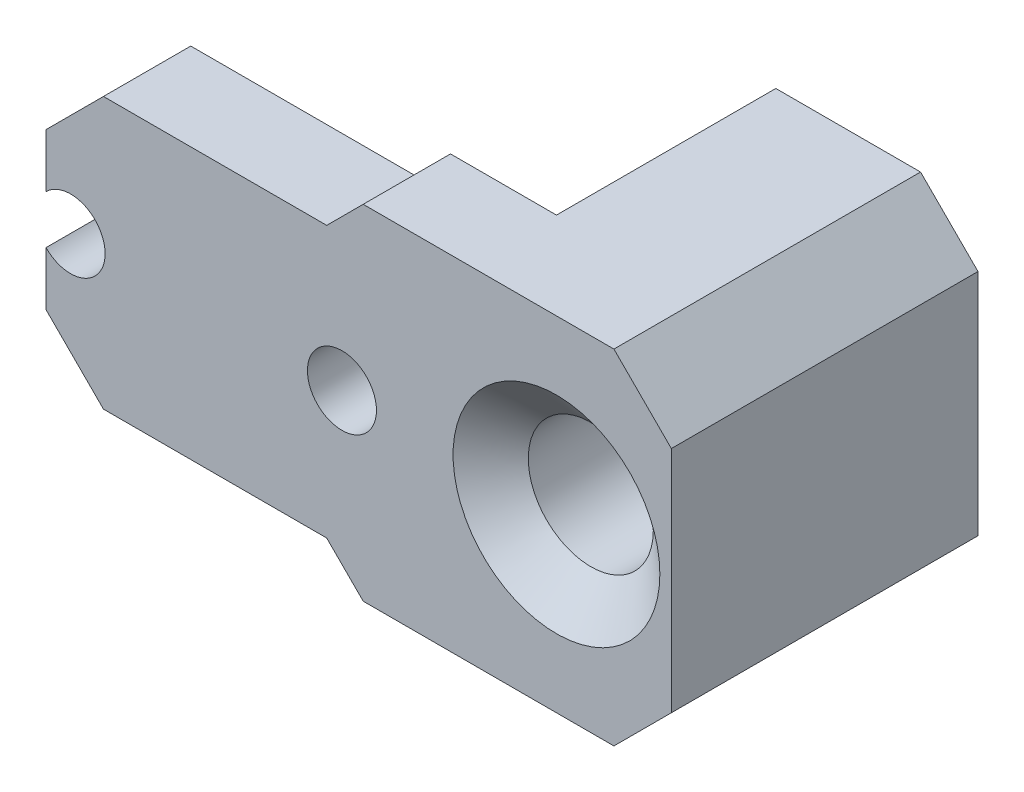
ISO-10303-21;
HEADER;
FILE_DESCRIPTION(('STEP AP214'),'2;1');
FILE_NAME('part.step','',(''),(''),'','','');
FILE_SCHEMA(('AUTOMOTIVE_DESIGN { 1 0 10303 214 1 1 1 1 }'));
ENDSEC;
DATA;
#1=APPLICATION_CONTEXT('core data for automotive mechanical design processes');
#2=APPLICATION_PROTOCOL_DEFINITION('international standard','automotive_design',2000,#1);
#3=PRODUCT_CONTEXT('',#1,'mechanical');
#4=PRODUCT('Part','Part','',(#3));
#5=PRODUCT_RELATED_PRODUCT_CATEGORY('part','',(#4));
#6=PRODUCT_DEFINITION_FORMATION('','',#4);
#7=PRODUCT_DEFINITION_CONTEXT('part definition',#1,'design');
#8=PRODUCT_DEFINITION('design','',#6,#7);
#9=PRODUCT_DEFINITION_SHAPE('','',#8);
#10=(LENGTH_UNIT() NAMED_UNIT(*) SI_UNIT(.MILLI.,.METRE.));
#11=(NAMED_UNIT(*) PLANE_ANGLE_UNIT() SI_UNIT($,.RADIAN.));
#12=(NAMED_UNIT(*) SI_UNIT($,.STERADIAN.) SOLID_ANGLE_UNIT());
#13=UNCERTAINTY_MEASURE_WITH_UNIT(LENGTH_MEASURE(1.E-05),#10,'distance_accuracy_value','');
#14=(GEOMETRIC_REPRESENTATION_CONTEXT(3) GLOBAL_UNCERTAINTY_ASSIGNED_CONTEXT((#13)) GLOBAL_UNIT_ASSIGNED_CONTEXT((#10,
#11,#12)) REPRESENTATION_CONTEXT('',''));
#15=CARTESIAN_POINT('',(0.,0.,0.));
#16=DIRECTION('',(0.,0.,1.));
#17=DIRECTION('',(1.,0.,0.));
#18=AXIS2_PLACEMENT_3D('',#15,#16,#17);
#19=CARTESIAN_POINT('',(12.604,-3.742,8.475));
#20=DIRECTION('',(0.,1.,0.));
#21=DIRECTION('',(-1.,0.,0.));
#22=AXIS2_PLACEMENT_3D('',#19,#20,#21);
#23=PLANE('',#22);
#24=DIRECTION('',(0.,0.,-1.));
#25=VECTOR('',#24,1.);
#26=CARTESIAN_POINT('',(-3.09192028803229,-3.742,8.475));
#27=LINE('',#26,#25);
#28=CARTESIAN_POINT('',(-3.09192028803229,-3.742,8.475));
#29=VERTEX_POINT('',#28);
#30=CARTESIAN_POINT('',(-3.09192028803229,-3.742,6.062));
#31=VERTEX_POINT('',#30);
#32=EDGE_CURVE('E334',#29,#31,#27,.T.);
#33=ORIENTED_EDGE('',*,*,#32,.T.);
#34=DIRECTION('',(1.,0.,0.));
#35=VECTOR('',#34,1.);
#36=CARTESIAN_POINT('',(12.604,-3.742,6.062));
#37=LINE('',#36,#35);
#38=CARTESIAN_POINT('',(3.07899999999998,-3.742,6.062));
#39=VERTEX_POINT('',#38);
#40=EDGE_CURVE('E454',#31,#39,#37,.T.);
#41=ORIENTED_EDGE('',*,*,#40,.T.);
#42=DIRECTION('',(0.,0.,1.));
#43=VECTOR('',#42,1.);
#44=CARTESIAN_POINT('',(3.07899999999998,-3.742,8.475));
#45=LINE('',#44,#43);
#46=CARTESIAN_POINT('',(3.07899999999998,-3.742,8.475));
#47=VERTEX_POINT('',#46);
#48=EDGE_CURVE('E317',#39,#47,#45,.T.);
#49=ORIENTED_EDGE('',*,*,#48,.T.);
#50=DIRECTION('',(1.,0.,0.));
#51=VECTOR('',#50,1.);
#52=CARTESIAN_POINT('',(12.604,-3.742,8.475));
#53=LINE('',#52,#51);
#54=EDGE_CURVE('E266',#29,#47,#53,.T.);
#55=ORIENTED_EDGE('',*,*,#54,.F.);
#56=EDGE_LOOP('',(#33,#41,#49,#55));
#57=FACE_BOUND('',#56,.T.);
#58=ADVANCED_FACE('F40',(#57),#23,.F.);
#59=CARTESIAN_POINT('',(12.604,3.742,8.475));
#60=DIRECTION('',(0.,-1.,0.));
#61=DIRECTION('',(1.,0.,0.));
#62=AXIS2_PLACEMENT_3D('',#59,#60,#61);
#63=PLANE('',#62);
#64=DIRECTION('',(0.,0.,-1.));
#65=VECTOR('',#64,1.);
#66=CARTESIAN_POINT('',(3.07899999999995,3.742,5.3));
#67=LINE('',#66,#65);
#68=CARTESIAN_POINT('',(3.07899999999995,3.742,8.475));
#69=VERTEX_POINT('',#68);
#70=CARTESIAN_POINT('',(3.07899999999995,3.742,6.062));
#71=VERTEX_POINT('',#70);
#72=EDGE_CURVE('E299',#69,#71,#67,.T.);
#73=ORIENTED_EDGE('',*,*,#72,.T.);
#74=DIRECTION('',(-1.,0.,0.));
#75=VECTOR('',#74,1.);
#76=CARTESIAN_POINT('',(12.604,3.742,6.062));
#77=LINE('',#76,#75);
#78=CARTESIAN_POINT('',(-3.09192028803229,3.742,6.062));
#79=VERTEX_POINT('',#78);
#80=EDGE_CURVE('E438',#71,#79,#77,.T.);
#81=ORIENTED_EDGE('',*,*,#80,.T.);
#82=DIRECTION('',(0.,0.,1.));
#83=VECTOR('',#82,1.);
#84=CARTESIAN_POINT('',(-3.09192028803229,3.742,8.475));
#85=LINE('',#84,#83);
#86=CARTESIAN_POINT('',(-3.09192028803228,3.742,8.475));
#87=VERTEX_POINT('',#86);
#88=EDGE_CURVE('E355',#79,#87,#85,.T.);
#89=ORIENTED_EDGE('',*,*,#88,.T.);
#90=DIRECTION('',(-1.,0.,0.));
#91=VECTOR('',#90,1.);
#92=CARTESIAN_POINT('',(12.604,3.742,8.475));
#93=LINE('',#92,#91);
#94=EDGE_CURVE('E288',#69,#87,#93,.T.);
#95=ORIENTED_EDGE('',*,*,#94,.F.);
#96=EDGE_LOOP('',(#73,#81,#89,#95));
#97=FACE_BOUND('',#96,.T.);
#98=ADVANCED_FACE('F542',(#97),#63,.F.);
#99=CARTESIAN_POINT('',(-4.67942028803229,-3.742,8.475));
#100=DIRECTION('',(1.,0.,0.));
#101=DIRECTION('',(0.,0.,-1.));
#102=AXIS2_PLACEMENT_3D('',#99,#100,#101);
#103=PLANE('',#102);
#104=DIRECTION('',(0.,0.,-1.));
#105=VECTOR('',#104,1.);
#106=CARTESIAN_POINT('',(-4.67942028803229,2.1545,8.475));
#107=LINE('',#106,#105);
#108=CARTESIAN_POINT('',(-4.67942028803229,2.1545,8.475));
#109=VERTEX_POINT('',#108);
#110=CARTESIAN_POINT('',(-4.67942028803229,2.1545,6.062));
#111=VERTEX_POINT('',#110);
#112=EDGE_CURVE('E352',#109,#111,#107,.T.);
#113=ORIENTED_EDGE('',*,*,#112,.T.);
#114=DIRECTION('',(0.,-1.,0.));
#115=VECTOR('',#114,1.);
#116=CARTESIAN_POINT('',(-4.67942028803229,-3.742,6.062));
#117=LINE('',#116,#115);
#118=CARTESIAN_POINT('',(-4.67942028803229,0.669704466320867,6.062));
#119=VERTEX_POINT('',#118);
#120=EDGE_CURVE('E250',#111,#119,#117,.T.);
#121=ORIENTED_EDGE('',*,*,#120,.T.);
#122=DIRECTION('',(0.,0.,1.));
#123=VECTOR('',#122,1.);
#124=CARTESIAN_POINT('',(-4.67942028803229,0.669704466320867,0.));
#125=LINE('',#124,#123);
#126=CARTESIAN_POINT('',(-4.67942028803229,0.669704466320867,8.475));
#127=VERTEX_POINT('',#126);
#128=EDGE_CURVE('E243',#119,#127,#125,.T.);
#129=ORIENTED_EDGE('',*,*,#128,.T.);
#130=DIRECTION('',(0.,-1.,0.));
#131=VECTOR('',#130,1.);
#132=CARTESIAN_POINT('',(-4.67942028803229,-3.742,8.475));
#133=LINE('',#132,#131);
#134=EDGE_CURVE('E247',#109,#127,#133,.T.);
#135=ORIENTED_EDGE('',*,*,#134,.F.);
#136=EDGE_LOOP('',(#113,#121,#129,#135));
#137=FACE_BOUND('',#136,.T.);
#138=ADVANCED_FACE('F246',(#137),#103,.F.);
#139=CARTESIAN_POINT('',(0.,0.,0.));
#140=DIRECTION('',(0.,0.,1.));
#141=DIRECTION('',(1.,0.,0.));
#142=AXIS2_PLACEMENT_3D('',#139,#140,#141);
#143=PLANE('',#142);
#144=CARTESIAN_POINT('',(9.429,0.,0.));
#145=DIRECTION('',(0.,0.,1.));
#146=DIRECTION('',(1.,0.,0.));
#147=AXIS2_PLACEMENT_3D('',#144,#145,#146);
#148=CIRCLE('',#147,1.7272);
#149=CARTESIAN_POINT('',(11.1562,0.,0.));
#150=VERTEX_POINT('',#149);
#151=EDGE_CURVE('E469',#150,#150,#148,.T.);
#152=ORIENTED_EDGE('',*,*,#151,.T.);
#153=EDGE_LOOP('',(#152));
#154=FACE_BOUND('',#153,.T.);
#155=DIRECTION('',(0.,-1.,0.));
#156=VECTOR('',#155,1.);
#157=CARTESIAN_POINT('',(6.254,4.75,0.));
#158=LINE('',#157,#156);
#159=CARTESIAN_POINT('',(6.254,3.988,0.));
#160=VERTEX_POINT('',#159);
#161=CARTESIAN_POINT('',(6.254,-3.988,0.));
#162=VERTEX_POINT('',#161);
#163=EDGE_CURVE('E294',#160,#162,#158,.T.);
#164=ORIENTED_EDGE('',*,*,#163,.F.);
#165=DIRECTION('',(-0.707106781186549,-0.707106781186546,0.));
#166=VECTOR('',#165,1.);
#167=CARTESIAN_POINT('',(6.254,3.988,0.));
#168=LINE('',#167,#166);
#169=CARTESIAN_POINT('',(7.016,4.75,0.));
#170=VERTEX_POINT('',#169);
#171=EDGE_CURVE('E389',#160,#170,#168,.F.);
#172=ORIENTED_EDGE('',*,*,#171,.T.);
#173=DIRECTION('',(-1.,0.,0.));
#174=VECTOR('',#173,1.);
#175=CARTESIAN_POINT('',(6.254,4.75,0.));
#176=LINE('',#175,#174);
#177=CARTESIAN_POINT('',(11.0165,4.75,0.));
#178=VERTEX_POINT('',#177);
#179=EDGE_CURVE('E300',#178,#170,#176,.T.);
#180=ORIENTED_EDGE('',*,*,#179,.F.);
#181=DIRECTION('',(-0.707106781186546,0.707106781186549,0.));
#182=VECTOR('',#181,1.);
#183=CARTESIAN_POINT('',(11.0165,4.75,0.));
#184=LINE('',#183,#182);
#185=CARTESIAN_POINT('',(12.604,3.16249999999999,0.));
#186=VERTEX_POINT('',#185);
#187=EDGE_CURVE('E366',#178,#186,#184,.F.);
#188=ORIENTED_EDGE('',*,*,#187,.T.);
#189=DIRECTION('',(0.,1.,0.));
#190=VECTOR('',#189,1.);
#191=CARTESIAN_POINT('',(12.604,4.75,0.));
#192=LINE('',#191,#190);
#193=CARTESIAN_POINT('',(12.604,-3.1625,0.));
#194=VERTEX_POINT('',#193);
#195=EDGE_CURVE('E307',#194,#186,#192,.T.);
#196=ORIENTED_EDGE('',*,*,#195,.F.);
#197=DIRECTION('',(0.707106781186549,0.707106781186546,0.));
#198=VECTOR('',#197,1.);
#199=CARTESIAN_POINT('',(12.604,-3.1625,0.));
#200=LINE('',#199,#198);
#201=CARTESIAN_POINT('',(11.0165,-4.75,0.));
#202=VERTEX_POINT('',#201);
#203=EDGE_CURVE('E362',#194,#202,#200,.F.);
#204=ORIENTED_EDGE('',*,*,#203,.T.);
#205=DIRECTION('',(1.,0.,0.));
#206=VECTOR('',#205,1.);
#207=CARTESIAN_POINT('',(6.254,-4.75,0.));
#208=LINE('',#207,#206);
#209=CARTESIAN_POINT('',(7.016,-4.75,0.));
#210=VERTEX_POINT('',#209);
#211=EDGE_CURVE('E304',#210,#202,#208,.T.);
#212=ORIENTED_EDGE('',*,*,#211,.F.);
#213=DIRECTION('',(0.707106781186546,-0.707106781186549,0.));
#214=VECTOR('',#213,1.);
#215=CARTESIAN_POINT('',(7.016,-4.75,0.));
#216=LINE('',#215,#214);
#217=EDGE_CURVE('E386',#210,#162,#216,.F.);
#218=ORIENTED_EDGE('',*,*,#217,.T.);
#219=EDGE_LOOP('',(#164,#172,#180,#188,#196,#204,#212,#218));
#220=FACE_BOUND('',#219,.T.);
#221=ADVANCED_FACE('F558',(#154,#220),#143,.F.);
#222=CARTESIAN_POINT('',(6.254,4.75,16.7268324569847));
#223=DIRECTION('',(0.,-1.,0.));
#224=DIRECTION('',(0.,0.,-1.));
#225=AXIS2_PLACEMENT_3D('',#222,#223,#224);
#226=PLANE('',#225);
#227=ORIENTED_EDGE('',*,*,#179,.T.);
#228=DIRECTION('',(0.,0.,1.));
#229=VECTOR('',#228,1.);
#230=CARTESIAN_POINT('',(7.016,4.75,16.7268324569847));
#231=LINE('',#230,#229);
#232=CARTESIAN_POINT('',(7.016,4.75,6.062));
#233=VERTEX_POINT('',#232);
#234=EDGE_CURVE('E395',#170,#233,#231,.T.);
#235=ORIENTED_EDGE('',*,*,#234,.T.);
#236=DIRECTION('',(-1.,0.,0.));
#237=VECTOR('',#236,1.);
#238=CARTESIAN_POINT('',(6.254,4.75,6.062));
#239=LINE('',#238,#237);
#240=CARTESIAN_POINT('',(4.08699999999996,4.75,6.062));
#241=VERTEX_POINT('',#240);
#242=EDGE_CURVE('E392',#233,#241,#239,.T.);
#243=ORIENTED_EDGE('',*,*,#242,.T.);
#244=DIRECTION('',(0.,0.,-1.));
#245=VECTOR('',#244,1.);
#246=CARTESIAN_POINT('',(4.08699999999996,4.75,16.7268324569847));
#247=LINE('',#246,#245);
#248=CARTESIAN_POINT('',(4.08699999999996,4.75,8.475));
#249=VERTEX_POINT('',#248);
#250=EDGE_CURVE('E320',#241,#249,#247,.F.);
#251=ORIENTED_EDGE('',*,*,#250,.T.);
#252=DIRECTION('',(-1.,0.,0.));
#253=VECTOR('',#252,1.);
#254=CARTESIAN_POINT('',(12.604,4.75,8.475));
#255=LINE('',#254,#253);
#256=CARTESIAN_POINT('',(11.0165,4.75,8.475));
#257=VERTEX_POINT('',#256);
#258=EDGE_CURVE('E272',#257,#249,#255,.T.);
#259=ORIENTED_EDGE('',*,*,#258,.F.);
#260=DIRECTION('',(0.,0.,-1.));
#261=VECTOR('',#260,1.);
#262=CARTESIAN_POINT('',(11.0165,4.75,16.7268324569847));
#263=LINE('',#262,#261);
#264=EDGE_CURVE('E358',#257,#178,#263,.T.);
#265=ORIENTED_EDGE('',*,*,#264,.T.);
#266=EDGE_LOOP('',(#227,#235,#243,#251,#259,#265));
#267=FACE_BOUND('',#266,.T.);
#268=ADVANCED_FACE('F561',(#267),#226,.F.);
#269=CARTESIAN_POINT('',(12.604,4.75,16.7268324569847));
#270=DIRECTION('',(-1.,0.,0.));
#271=DIRECTION('',(0.,0.,1.));
#272=AXIS2_PLACEMENT_3D('',#269,#270,#271);
#273=PLANE('',#272);
#274=ORIENTED_EDGE('',*,*,#195,.T.);
#275=DIRECTION('',(0.,0.,1.));
#276=VECTOR('',#275,1.);
#277=CARTESIAN_POINT('',(12.604,3.16249999999999,16.7268324569847));
#278=LINE('',#277,#276);
#279=CARTESIAN_POINT('',(12.604,3.16249999999999,8.475));
#280=VERTEX_POINT('',#279);
#281=EDGE_CURVE('E373',#186,#280,#278,.T.);
#282=ORIENTED_EDGE('',*,*,#281,.T.);
#283=DIRECTION('',(0.,1.,0.));
#284=VECTOR('',#283,1.);
#285=CARTESIAN_POINT('',(12.604,-3.742,8.475));
#286=LINE('',#285,#284);
#287=CARTESIAN_POINT('',(12.604,-3.1625,8.475));
#288=VERTEX_POINT('',#287);
#289=EDGE_CURVE('E253',#288,#280,#286,.T.);
#290=ORIENTED_EDGE('',*,*,#289,.F.);
#291=DIRECTION('',(0.,0.,-1.));
#292=VECTOR('',#291,1.);
#293=CARTESIAN_POINT('',(12.604,-3.1625,16.7268324569847));
#294=LINE('',#293,#292);
#295=EDGE_CURVE('E369',#288,#194,#294,.T.);
#296=ORIENTED_EDGE('',*,*,#295,.T.);
#297=EDGE_LOOP('',(#274,#282,#290,#296));
#298=FACE_BOUND('',#297,.T.);
#299=ADVANCED_FACE('F565',(#298),#273,.F.);
#300=CARTESIAN_POINT('',(6.254,-4.75,16.7268324569847));
#301=DIRECTION('',(0.,1.,0.));
#302=DIRECTION('',(0.,0.,1.));
#303=AXIS2_PLACEMENT_3D('',#300,#301,#302);
#304=PLANE('',#303);
#305=DIRECTION('',(1.,0.,0.));
#306=VECTOR('',#305,1.);
#307=CARTESIAN_POINT('',(6.254,-4.75,6.062));
#308=LINE('',#307,#306);
#309=CARTESIAN_POINT('',(4.08699999999997,-4.75,6.062));
#310=VERTEX_POINT('',#309);
#311=CARTESIAN_POINT('',(7.016,-4.75,6.062));
#312=VERTEX_POINT('',#311);
#313=EDGE_CURVE('E445',#310,#312,#308,.T.);
#314=ORIENTED_EDGE('',*,*,#313,.T.);
#315=DIRECTION('',(0.,0.,-1.));
#316=VECTOR('',#315,1.);
#317=CARTESIAN_POINT('',(7.016,-4.75,16.7268324569847));
#318=LINE('',#317,#316);
#319=EDGE_CURVE('E448',#312,#210,#318,.T.);
#320=ORIENTED_EDGE('',*,*,#319,.T.);
#321=ORIENTED_EDGE('',*,*,#211,.T.);
#322=DIRECTION('',(0.,0.,1.));
#323=VECTOR('',#322,1.);
#324=CARTESIAN_POINT('',(11.0165,-4.75,16.7268324569847));
#325=LINE('',#324,#323);
#326=CARTESIAN_POINT('',(11.0165,-4.75,8.475));
#327=VERTEX_POINT('',#326);
#328=EDGE_CURVE('E376',#202,#327,#325,.T.);
#329=ORIENTED_EDGE('',*,*,#328,.T.);
#330=DIRECTION('',(1.,0.,0.));
#331=VECTOR('',#330,1.);
#332=CARTESIAN_POINT('',(6.254,-4.75,8.475));
#333=LINE('',#332,#331);
#334=CARTESIAN_POINT('',(4.08699999999997,-4.75,8.475));
#335=VERTEX_POINT('',#334);
#336=EDGE_CURVE('E280',#335,#327,#333,.T.);
#337=ORIENTED_EDGE('',*,*,#336,.F.);
#338=DIRECTION('',(0.,0.,1.));
#339=VECTOR('',#338,1.);
#340=CARTESIAN_POINT('',(4.08699999999997,-4.75,16.7268324569847));
#341=LINE('',#340,#339);
#342=EDGE_CURVE('E326',#335,#310,#341,.F.);
#343=ORIENTED_EDGE('',*,*,#342,.T.);
#344=EDGE_LOOP('',(#314,#320,#321,#329,#337,#343));
#345=FACE_BOUND('',#344,.T.);
#346=ADVANCED_FACE('F569',(#345),#304,.F.);
#347=CARTESIAN_POINT('',(6.254,4.75,16.7268324569847));
#348=DIRECTION('',(1.,0.,0.));
#349=DIRECTION('',(0.,1.,0.));
#350=AXIS2_PLACEMENT_3D('',#347,#348,#349);
#351=PLANE('',#350);
#352=DIRECTION('',(0.,1.,0.));
#353=VECTOR('',#352,1.);
#354=CARTESIAN_POINT('',(6.254,4.75,5.3));
#355=LINE('',#354,#353);
#356=CARTESIAN_POINT('',(6.254,-3.988,5.3));
#357=VERTEX_POINT('',#356);
#358=CARTESIAN_POINT('',(6.254,3.988,5.3));
#359=VERTEX_POINT('',#358);
#360=EDGE_CURVE('E295',#357,#359,#355,.T.);
#361=ORIENTED_EDGE('',*,*,#360,.T.);
#362=DIRECTION('',(0.,0.,-1.));
#363=VECTOR('',#362,1.);
#364=CARTESIAN_POINT('',(6.254,3.988,16.7268324569847));
#365=LINE('',#364,#363);
#366=EDGE_CURVE('E382',#359,#160,#365,.T.);
#367=ORIENTED_EDGE('',*,*,#366,.T.);
#368=ORIENTED_EDGE('',*,*,#163,.T.);
#369=DIRECTION('',(0.,0.,1.));
#370=VECTOR('',#369,1.);
#371=CARTESIAN_POINT('',(6.254,-3.988,16.7268324569847));
#372=LINE('',#371,#370);
#373=EDGE_CURVE('E379',#162,#357,#372,.T.);
#374=ORIENTED_EDGE('',*,*,#373,.T.);
#375=EDGE_LOOP('',(#361,#367,#368,#374));
#376=FACE_BOUND('',#375,.T.);
#377=ADVANCED_FACE('F556',(#376),#351,.F.);
#378=DIRECTION('',(0.,0.,1.));
#379=VECTOR('',#378,1.);
#380=CARTESIAN_POINT('',(-4.67942028803229,-0.669704466320867,0.));
#381=LINE('',#380,#379);
#382=CARTESIAN_POINT('',(-4.67942028803229,-0.669704466320867,8.475));
#383=VERTEX_POINT('',#382);
#384=CARTESIAN_POINT('',(-4.67942028803229,-0.669704466320867,6.062));
#385=VERTEX_POINT('',#384);
#386=EDGE_CURVE('E254',#383,#385,#381,.F.);
#387=ORIENTED_EDGE('',*,*,#386,.T.);
#388=DIRECTION('',(0.,-1.,0.));
#389=VECTOR('',#388,1.);
#390=CARTESIAN_POINT('',(-4.67942028803229,-3.742,6.062));
#391=LINE('',#390,#389);
#392=CARTESIAN_POINT('',(-4.67942028803229,-2.1545,6.062));
#393=VERTEX_POINT('',#392);
#394=EDGE_CURVE('E69',#385,#393,#391,.T.);
#395=ORIENTED_EDGE('',*,*,#394,.T.);
#396=DIRECTION('',(0.,0.,1.));
#397=VECTOR('',#396,1.);
#398=CARTESIAN_POINT('',(-4.67942028803229,-2.1545,8.475));
#399=LINE('',#398,#397);
#400=CARTESIAN_POINT('',(-4.67942028803229,-2.1545,8.475));
#401=VERTEX_POINT('',#400);
#402=EDGE_CURVE('E338',#393,#401,#399,.T.);
#403=ORIENTED_EDGE('',*,*,#402,.T.);
#404=EDGE_CURVE('E267',#383,#401,#133,.T.);
#405=ORIENTED_EDGE('',*,*,#404,.F.);
#406=EDGE_LOOP('',(#387,#395,#403,#405));
#407=FACE_BOUND('',#406,.T.);
#408=ADVANCED_FACE('F554',(#407),#103,.F.);
#409=CARTESIAN_POINT('',(0.,0.,8.475));
#410=DIRECTION('',(0.,0.,1.));
#411=DIRECTION('',(1.,0.,0.));
#412=AXIS2_PLACEMENT_3D('',#409,#410,#411);
#413=PLANE('',#412);
#414=CARTESIAN_POINT('',(9.429,0.,8.475));
#415=DIRECTION('',(0.,0.,1.));
#416=DIRECTION('',(1.,0.,0.));
#417=AXIS2_PLACEMENT_3D('',#414,#415,#416);
#418=CIRCLE('',#417,2.8575);
#419=CARTESIAN_POINT('',(12.2865,0.,8.475));
#420=VERTEX_POINT('',#419);
#421=EDGE_CURVE('E663',#420,#420,#418,.T.);
#422=ORIENTED_EDGE('',*,*,#421,.F.);
#423=EDGE_LOOP('',(#422));
#424=FACE_BOUND('',#423,.T.);
#425=CARTESIAN_POINT('',(3.5,0.,8.475));
#426=DIRECTION('',(0.,0.,1.));
#427=DIRECTION('',(1.,0.,0.));
#428=AXIS2_PLACEMENT_3D('',#425,#426,#427);
#429=CIRCLE('',#428,0.954);
#430=CARTESIAN_POINT('',(4.454,0.,8.475));
#431=VERTEX_POINT('',#430);
#432=EDGE_CURVE('E271',#431,#431,#429,.T.);
#433=ORIENTED_EDGE('',*,*,#432,.F.);
#434=EDGE_LOOP('',(#433));
#435=FACE_BOUND('',#434,.T.);
#436=ORIENTED_EDGE('',*,*,#404,.T.);
#437=DIRECTION('',(-0.707106781186547,0.707106781186548,0.));
#438=VECTOR('',#437,1.);
#439=CARTESIAN_POINT('',(-3.41696014401615,-3.41696014401614,8.475));
#440=LINE('',#439,#438);
#441=EDGE_CURVE('E349',#401,#29,#440,.F.);
#442=ORIENTED_EDGE('',*,*,#441,.T.);
#443=ORIENTED_EDGE('',*,*,#54,.T.);
#444=DIRECTION('',(-0.707106781186544,0.707106781186551,0.));
#445=VECTOR('',#444,1.);
#446=CARTESIAN_POINT('',(6.254,-6.91700000000006,8.475));
#447=LINE('',#446,#445);
#448=EDGE_CURVE('E330',#47,#335,#447,.F.);
#449=ORIENTED_EDGE('',*,*,#448,.T.);
#450=ORIENTED_EDGE('',*,*,#336,.T.);
#451=DIRECTION('',(-0.707106781186549,-0.707106781186546,0.));
#452=VECTOR('',#451,1.);
#453=CARTESIAN_POINT('',(7.88324999999998,-7.88325000000001,8.475));
#454=LINE('',#453,#452);
#455=EDGE_CURVE('E341',#327,#288,#454,.F.);
#456=ORIENTED_EDGE('',*,*,#455,.T.);
#457=ORIENTED_EDGE('',*,*,#289,.T.);
#458=DIRECTION('',(0.707106781186546,-0.707106781186549,0.));
#459=VECTOR('',#458,1.);
#460=CARTESIAN_POINT('',(7.88325000000003,7.88324999999999,8.475));
#461=LINE('',#460,#459);
#462=EDGE_CURVE('E344',#280,#257,#461,.F.);
#463=ORIENTED_EDGE('',*,*,#462,.T.);
#464=ORIENTED_EDGE('',*,*,#258,.T.);
#465=DIRECTION('',(0.707106781186551,0.707106781186544,0.));
#466=VECTOR('',#465,1.);
#467=CARTESIAN_POINT('',(3.07899999999995,3.742,8.475));
#468=LINE('',#467,#466);
#469=EDGE_CURVE('E323',#249,#69,#468,.F.);
#470=ORIENTED_EDGE('',*,*,#469,.T.);
#471=ORIENTED_EDGE('',*,*,#94,.T.);
#472=DIRECTION('',(0.707106781186549,0.707106781186546,0.));
#473=VECTOR('',#472,1.);
#474=CARTESIAN_POINT('',(-3.41696014401614,3.41696014401615,8.475));
#475=LINE('',#474,#473);
#476=EDGE_CURVE('E264',#87,#109,#475,.F.);
#477=ORIENTED_EDGE('',*,*,#476,.T.);
#478=ORIENTED_EDGE('',*,*,#134,.T.);
#479=CARTESIAN_POINT('',(-4.,0.,8.475));
#480=DIRECTION('',(0.,0.,1.));
#481=DIRECTION('',(1.,0.,0.));
#482=AXIS2_PLACEMENT_3D('',#479,#480,#481);
#483=CIRCLE('',#482,0.954);
#484=EDGE_CURVE('E260',#383,#127,#483,.T.);
#485=ORIENTED_EDGE('',*,*,#484,.F.);
#486=EDGE_LOOP('',(#436,#442,#443,#449,#450,#456,#457,#463,#464,#470,#471,#477,#478,#485));
#487=FACE_BOUND('',#486,.T.);
#488=ADVANCED_FACE('F259',(#424,#435,#487),#413,.T.);
#489=CARTESIAN_POINT('',(0.,0.,5.3));
#490=DIRECTION('',(0.,0.,1.));
#491=DIRECTION('',(1.,0.,0.));
#492=AXIS2_PLACEMENT_3D('',#489,#490,#491);
#493=PLANE('',#492);
#494=CARTESIAN_POINT('',(3.5,0.,5.3));
#495=DIRECTION('',(0.,0.,1.));
#496=DIRECTION('',(1.,0.,0.));
#497=AXIS2_PLACEMENT_3D('',#494,#495,#496);
#498=CIRCLE('',#497,1.716);
#499=CARTESIAN_POINT('',(5.216,0.,5.3));
#500=VERTEX_POINT('',#499);
#501=EDGE_CURVE('E398',#500,#500,#498,.T.);
#502=ORIENTED_EDGE('',*,*,#501,.T.);
#503=EDGE_LOOP('',(#502));
#504=FACE_BOUND('',#503,.T.);
#505=DIRECTION('',(0.707106781186551,0.707106781186544,0.));
#506=VECTOR('',#505,1.);
#507=CARTESIAN_POINT('',(0.207315367264102,-0.207315367264104,5.3));
#508=LINE('',#507,#506);
#509=CARTESIAN_POINT('',(3.39463073452824,2.98,5.3));
#510=VERTEX_POINT('',#509);
#511=CARTESIAN_POINT('',(4.40263073452825,3.988,5.3));
#512=VERTEX_POINT('',#511);
#513=EDGE_CURVE('E429',#510,#512,#508,.T.);
#514=ORIENTED_EDGE('',*,*,#513,.T.);
#515=DIRECTION('',(1.,0.,0.));
#516=VECTOR('',#515,1.);
#517=CARTESIAN_POINT('',(0.,3.988,5.3));
#518=LINE('',#517,#516);
#519=EDGE_CURVE('E432',#512,#359,#518,.T.);
#520=ORIENTED_EDGE('',*,*,#519,.T.);
#521=ORIENTED_EDGE('',*,*,#360,.F.);
#522=DIRECTION('',(-1.,0.,0.));
#523=VECTOR('',#522,1.);
#524=CARTESIAN_POINT('',(0.,-3.988,5.3));
#525=LINE('',#524,#523);
#526=CARTESIAN_POINT('',(4.40263073452827,-3.988,5.3));
#527=VERTEX_POINT('',#526);
#528=EDGE_CURVE('E417',#357,#527,#525,.T.);
#529=ORIENTED_EDGE('',*,*,#528,.T.);
#530=DIRECTION('',(-0.707106781186544,0.707106781186551,0.));
#531=VECTOR('',#530,1.);
#532=CARTESIAN_POINT('',(0.207315367264156,0.207315367264154,5.3));
#533=LINE('',#532,#531);
#534=CARTESIAN_POINT('',(3.39463073452828,-2.98,5.3));
#535=VERTEX_POINT('',#534);
#536=EDGE_CURVE('E414',#527,#535,#533,.T.);
#537=ORIENTED_EDGE('',*,*,#536,.T.);
#538=DIRECTION('',(-1.,0.,0.));
#539=VECTOR('',#538,1.);
#540=CARTESIAN_POINT('',(0.,-2.98,5.3));
#541=LINE('',#540,#539);
#542=CARTESIAN_POINT('',(-2.77628955350399,-2.98000000000001,5.3));
#543=VERTEX_POINT('',#542);
#544=EDGE_CURVE('E411',#535,#543,#541,.T.);
#545=ORIENTED_EDGE('',*,*,#544,.T.);
#546=DIRECTION('',(-0.707106781186547,0.707106781186548,0.));
#547=VECTOR('',#546,1.);
#548=CARTESIAN_POINT('',(-4.14060492076815,-1.61568463273585,5.3));
#549=LINE('',#548,#547);
#550=CARTESIAN_POINT('',(-3.9174202880323,-1.8388692654717,5.3));
#551=VERTEX_POINT('',#550);
#552=EDGE_CURVE('E408',#543,#551,#549,.T.);
#553=ORIENTED_EDGE('',*,*,#552,.T.);
#554=DIRECTION('',(0.,1.,0.));
#555=VECTOR('',#554,1.);
#556=CARTESIAN_POINT('',(-3.9174202880323,0.,5.3));
#557=LINE('',#556,#555);
#558=CARTESIAN_POINT('',(-3.9174202880323,-1.71401184102424,5.3));
#559=VERTEX_POINT('',#558);
#560=EDGE_CURVE('E405',#551,#559,#557,.T.);
#561=ORIENTED_EDGE('',*,*,#560,.T.);
#562=CARTESIAN_POINT('',(-4.,0.,5.3));
#563=DIRECTION('',(0.,0.,1.));
#564=DIRECTION('',(1.,0.,0.));
#565=AXIS2_PLACEMENT_3D('',#562,#563,#564);
#566=CIRCLE('',#565,1.716);
#567=CARTESIAN_POINT('',(-3.9174202880323,1.71401184102424,5.3));
#568=VERTEX_POINT('',#567);
#569=EDGE_CURVE('E402',#559,#568,#566,.T.);
#570=ORIENTED_EDGE('',*,*,#569,.T.);
#571=DIRECTION('',(0.,1.,0.));
#572=VECTOR('',#571,1.);
#573=CARTESIAN_POINT('',(-3.9174202880323,0.,5.3));
#574=LINE('',#573,#572);
#575=CARTESIAN_POINT('',(-3.9174202880323,1.8388692654717,5.3));
#576=VERTEX_POINT('',#575);
#577=EDGE_CURVE('E420',#568,#576,#574,.T.);
#578=ORIENTED_EDGE('',*,*,#577,.T.);
#579=DIRECTION('',(0.707106781186549,0.707106781186546,0.));
#580=VECTOR('',#579,1.);
#581=CARTESIAN_POINT('',(-2.55310492076814,3.20318463273585,5.3));
#582=LINE('',#581,#580);
#583=CARTESIAN_POINT('',(-2.77628955350399,2.98,5.3));
#584=VERTEX_POINT('',#583);
#585=EDGE_CURVE('E423',#576,#584,#582,.T.);
#586=ORIENTED_EDGE('',*,*,#585,.T.);
#587=DIRECTION('',(1.,0.,0.));
#588=VECTOR('',#587,1.);
#589=CARTESIAN_POINT('',(0.,2.98,5.3));
#590=LINE('',#589,#588);
#591=EDGE_CURVE('E426',#584,#510,#590,.T.);
#592=ORIENTED_EDGE('',*,*,#591,.T.);
#593=EDGE_LOOP('',(#514,#520,#521,#529,#537,#545,#553,#561,#570,#578,#586,#592));
#594=FACE_BOUND('',#593,.T.);
#595=ADVANCED_FACE('F552',(#504,#594),#493,.F.);
#596=CARTESIAN_POINT('',(-4.,0.,0.));
#597=DIRECTION('',(0.,0.,1.));
#598=DIRECTION('',(1.,0.,0.));
#599=AXIS2_PLACEMENT_3D('',#596,#597,#598);
#600=CYLINDRICAL_SURFACE('',#599,0.954);
#601=ORIENTED_EDGE('',*,*,#128,.F.);
#602=CARTESIAN_POINT('',(-4.,0.,6.062));
#603=DIRECTION('',(0.,0.,1.));
#604=DIRECTION('',(1.,0.,0.));
#605=AXIS2_PLACEMENT_3D('',#602,#603,#604);
#606=CIRCLE('',#605,0.954);
#607=EDGE_CURVE('E50',#119,#385,#606,.F.);
#608=ORIENTED_EDGE('',*,*,#607,.T.);
#609=ORIENTED_EDGE('',*,*,#386,.F.);
#610=ORIENTED_EDGE('',*,*,#484,.T.);
#611=EDGE_LOOP('',(#601,#608,#609,#610));
#612=FACE_BOUND('',#611,.T.);
#613=ADVANCED_FACE('F269',(#612),#600,.F.);
#614=CARTESIAN_POINT('',(3.5,0.,0.));
#615=DIRECTION('',(0.,0.,1.));
#616=DIRECTION('',(1.,0.,0.));
#617=AXIS2_PLACEMENT_3D('',#614,#615,#616);
#618=CYLINDRICAL_SURFACE('',#617,0.954);
#619=CARTESIAN_POINT('',(3.5,0.,6.062));
#620=DIRECTION('',(0.,0.,1.));
#621=DIRECTION('',(1.,0.,0.));
#622=AXIS2_PLACEMENT_3D('',#619,#620,#621);
#623=CIRCLE('',#622,0.954);
#624=CARTESIAN_POINT('',(4.454,0.,6.062));
#625=VERTEX_POINT('',#624);
#626=EDGE_CURVE('E11',#625,#625,#623,.F.);
#627=ORIENTED_EDGE('',*,*,#626,.T.);
#628=EDGE_LOOP('',(#627));
#629=FACE_BOUND('',#628,.T.);
#630=ORIENTED_EDGE('',*,*,#432,.T.);
#631=EDGE_LOOP('',(#630));
#632=FACE_BOUND('',#631,.T.);
#633=ADVANCED_FACE('F581',(#629,#632),#618,.F.);
#634=CARTESIAN_POINT('',(3.07899999999995,3.742,8.475));
#635=DIRECTION('',(-0.707106781186544,0.707106781186551,0.));
#636=DIRECTION('',(0.,0.,1.));
#637=AXIS2_PLACEMENT_3D('',#634,#635,#636);
#638=PLANE('',#637);
#639=ORIENTED_EDGE('',*,*,#250,.F.);
#640=DIRECTION('',(0.707106781186551,0.707106781186544,0.));
#641=VECTOR('',#640,1.);
#642=CARTESIAN_POINT('',(3.07899999999995,3.742,6.062));
#643=LINE('',#642,#641);
#644=EDGE_CURVE('E435',#241,#71,#643,.F.);
#645=ORIENTED_EDGE('',*,*,#644,.T.);
#646=ORIENTED_EDGE('',*,*,#72,.F.);
#647=ORIENTED_EDGE('',*,*,#469,.F.);
#648=EDGE_LOOP('',(#639,#645,#646,#647));
#649=FACE_BOUND('',#648,.T.);
#650=ADVANCED_FACE('F577',(#649),#638,.T.);
#651=CARTESIAN_POINT('',(6.254,-6.91700000000006,16.7268324569847));
#652=DIRECTION('',(-0.707106781186551,-0.707106781186544,0.));
#653=DIRECTION('',(0.,0.,1.));
#654=AXIS2_PLACEMENT_3D('',#651,#652,#653);
#655=PLANE('',#654);
#656=ORIENTED_EDGE('',*,*,#48,.F.);
#657=DIRECTION('',(-0.707106781186544,0.707106781186551,0.));
#658=VECTOR('',#657,1.);
#659=CARTESIAN_POINT('',(6.254,-6.91700000000006,6.062));
#660=LINE('',#659,#658);
#661=EDGE_CURVE('E451',#39,#310,#660,.F.);
#662=ORIENTED_EDGE('',*,*,#661,.T.);
#663=ORIENTED_EDGE('',*,*,#342,.F.);
#664=ORIENTED_EDGE('',*,*,#448,.F.);
#665=EDGE_LOOP('',(#656,#662,#663,#664));
#666=FACE_BOUND('',#665,.T.);
#667=ADVANCED_FACE('F580',(#666),#655,.T.);
#668=CARTESIAN_POINT('',(-3.09192028803229,-3.742,8.475));
#669=DIRECTION('',(0.707106781186548,0.707106781186547,0.));
#670=DIRECTION('',(0.,0.,-1.));
#671=AXIS2_PLACEMENT_3D('',#668,#669,#670);
#672=PLANE('',#671);
#673=ORIENTED_EDGE('',*,*,#402,.F.);
#674=DIRECTION('',(-0.707106781186547,0.707106781186548,0.));
#675=VECTOR('',#674,1.);
#676=CARTESIAN_POINT('',(-3.09192028803229,-3.74200000000001,6.062));
#677=LINE('',#676,#675);
#678=EDGE_CURVE('E457',#393,#31,#677,.F.);
#679=ORIENTED_EDGE('',*,*,#678,.T.);
#680=ORIENTED_EDGE('',*,*,#32,.F.);
#681=ORIENTED_EDGE('',*,*,#441,.F.);
#682=EDGE_LOOP('',(#673,#679,#680,#681));
#683=FACE_BOUND('',#682,.T.);
#684=ADVANCED_FACE('F585',(#683),#672,.F.);
#685=CARTESIAN_POINT('',(-4.67942028803229,2.1545,8.475));
#686=DIRECTION('',(0.707106781186546,-0.707106781186549,0.));
#687=DIRECTION('',(0.,0.,-1.));
#688=AXIS2_PLACEMENT_3D('',#685,#686,#687);
#689=PLANE('',#688);
#690=ORIENTED_EDGE('',*,*,#88,.F.);
#691=DIRECTION('',(0.707106781186549,0.707106781186546,0.));
#692=VECTOR('',#691,1.);
#693=CARTESIAN_POINT('',(-4.67942028803229,2.1545,6.062));
#694=LINE('',#693,#692);
#695=EDGE_CURVE('E440',#79,#111,#694,.F.);
#696=ORIENTED_EDGE('',*,*,#695,.T.);
#697=ORIENTED_EDGE('',*,*,#112,.F.);
#698=ORIENTED_EDGE('',*,*,#476,.F.);
#699=EDGE_LOOP('',(#690,#696,#697,#698));
#700=FACE_BOUND('',#699,.T.);
#701=ADVANCED_FACE('F589',(#700),#689,.F.);
#702=CARTESIAN_POINT('',(11.0165,4.75,16.7268324569847));
#703=DIRECTION('',(-0.707106781186549,-0.707106781186546,0.));
#704=DIRECTION('',(0.,0.,-1.));
#705=AXIS2_PLACEMENT_3D('',#702,#703,#704);
#706=PLANE('',#705);
#707=ORIENTED_EDGE('',*,*,#462,.F.);
#708=ORIENTED_EDGE('',*,*,#281,.F.);
#709=ORIENTED_EDGE('',*,*,#187,.F.);
#710=ORIENTED_EDGE('',*,*,#264,.F.);
#711=EDGE_LOOP('',(#707,#708,#709,#710));
#712=FACE_BOUND('',#711,.T.);
#713=ADVANCED_FACE('F537',(#712),#706,.F.);
#714=CARTESIAN_POINT('',(12.604,-3.1625,16.7268324569847));
#715=DIRECTION('',(-0.707106781186546,0.707106781186549,0.));
#716=DIRECTION('',(0.,0.,-1.));
#717=AXIS2_PLACEMENT_3D('',#714,#715,#716);
#718=PLANE('',#717);
#719=ORIENTED_EDGE('',*,*,#455,.F.);
#720=ORIENTED_EDGE('',*,*,#328,.F.);
#721=ORIENTED_EDGE('',*,*,#203,.F.);
#722=ORIENTED_EDGE('',*,*,#295,.F.);
#723=EDGE_LOOP('',(#719,#720,#721,#722));
#724=FACE_BOUND('',#723,.T.);
#725=ADVANCED_FACE('F532',(#724),#718,.F.);
#726=CARTESIAN_POINT('',(7.016,-4.75,16.7268324569847));
#727=DIRECTION('',(0.707106781186549,0.707106781186546,0.));
#728=DIRECTION('',(0.,0.,-1.));
#729=AXIS2_PLACEMENT_3D('',#726,#727,#728);
#730=PLANE('',#729);
#731=ORIENTED_EDGE('',*,*,#217,.F.);
#732=ORIENTED_EDGE('',*,*,#319,.F.);
#733=DIRECTION('',(0.577350269189623,-0.577350269189626,0.577350269189628));
#734=VECTOR('',#733,1.);
#735=CARTESIAN_POINT('',(10.5709441523282,-8.30494415232826,9.61694415232828));
#736=LINE('',#735,#734);
#737=EDGE_CURVE('E44',#357,#312,#736,.T.);
#738=ORIENTED_EDGE('',*,*,#737,.F.);
#739=ORIENTED_EDGE('',*,*,#373,.F.);
#740=EDGE_LOOP('',(#731,#732,#738,#739));
#741=FACE_BOUND('',#740,.T.);
#742=ADVANCED_FACE('F529',(#741),#730,.F.);
#743=CARTESIAN_POINT('',(0.,-3.988,5.3));
#744=DIRECTION('',(0.,0.707106781186549,0.707106781186546));
#745=DIRECTION('',(-1.,0.,0.));
#746=AXIS2_PLACEMENT_3D('',#743,#744,#745);
#747=PLANE('',#746);
#748=ORIENTED_EDGE('',*,*,#737,.T.);
#749=ORIENTED_EDGE('',*,*,#313,.F.);
#750=DIRECTION('',(0.281084637714822,0.678598344545845,-0.678598344545848));
#751=VECTOR('',#750,1.);
#752=CARTESIAN_POINT('',(4.87139428144635,-2.85630468748426,4.16830468748425));
#753=LINE('',#752,#751);
#754=EDGE_CURVE('E640',#527,#310,#753,.F.);
#755=ORIENTED_EDGE('',*,*,#754,.F.);
#756=ORIENTED_EDGE('',*,*,#528,.F.);
#757=EDGE_LOOP('',(#748,#749,#755,#756));
#758=FACE_BOUND('',#757,.T.);
#759=ADVANCED_FACE('F526',(#758),#747,.F.);
#760=CARTESIAN_POINT('',(0.207315367264156,0.207315367264154,5.3));
#761=DIRECTION('',(-0.500000000000004,-0.499999999999998,-0.707106781186546));
#762=DIRECTION('',(0.707106781186544,-0.707106781186551,0.));
#763=AXIS2_PLACEMENT_3D('',#760,#761,#762);
#764=PLANE('',#763);
#765=ORIENTED_EDGE('',*,*,#754,.T.);
#766=ORIENTED_EDGE('',*,*,#661,.F.);
#767=DIRECTION('',(0.281084637714822,0.678598344545845,-0.678598344545848));
#768=VECTOR('',#767,1.);
#769=CARTESIAN_POINT('',(3.75076540520492,-2.1202148480212,4.44021484802119));
#770=LINE('',#769,#768);
#771=EDGE_CURVE('E635',#535,#39,#770,.F.);
#772=ORIENTED_EDGE('',*,*,#771,.F.);
#773=ORIENTED_EDGE('',*,*,#536,.F.);
#774=EDGE_LOOP('',(#765,#766,#772,#773));
#775=FACE_BOUND('',#774,.T.);
#776=ADVANCED_FACE('F522',(#775),#764,.T.);
#777=CARTESIAN_POINT('',(12.604,-3.742,6.062));
#778=DIRECTION('',(0.,0.707106781186549,0.707106781186546));
#779=DIRECTION('',(1.,0.,0.));
#780=AXIS2_PLACEMENT_3D('',#777,#778,#779);
#781=PLANE('',#780);
#782=ORIENTED_EDGE('',*,*,#771,.T.);
#783=ORIENTED_EDGE('',*,*,#40,.F.);
#784=DIRECTION('',(-0.281084637714821,-0.678598344545845,0.678598344545848));
#785=VECTOR('',#784,1.);
#786=CARTESIAN_POINT('',(-2.76490876051417,-2.95252433521341,5.2725243352134));
#787=LINE('',#786,#785);
#788=EDGE_CURVE('E631',#543,#31,#787,.T.);
#789=ORIENTED_EDGE('',*,*,#788,.F.);
#790=ORIENTED_EDGE('',*,*,#544,.F.);
#791=EDGE_LOOP('',(#782,#783,#789,#790));
#792=FACE_BOUND('',#791,.T.);
#793=ADVANCED_FACE('F518',(#792),#781,.F.);
#794=CARTESIAN_POINT('',(-2.878144776752,-2.878144776752,5.3));
#795=DIRECTION('',(0.500000000000001,0.5,0.707106781186546));
#796=DIRECTION('',(-0.707106781186547,0.707106781186548,0.));
#797=AXIS2_PLACEMENT_3D('',#794,#795,#796);
#798=PLANE('',#797);
#799=ORIENTED_EDGE('',*,*,#788,.T.);
#800=ORIENTED_EDGE('',*,*,#678,.F.);
#801=DIRECTION('',(-0.678598344545846,-0.28108463771482,0.678598344545849));
#802=VECTOR('',#801,1.);
#803=CARTESIAN_POINT('',(-4.98222570513829,-2.27992611052534,6.36480541710599));
#804=LINE('',#803,#802);
#805=EDGE_CURVE('E628',#551,#393,#804,.T.);
#806=ORIENTED_EDGE('',*,*,#805,.F.);
#807=ORIENTED_EDGE('',*,*,#552,.F.);
#808=EDGE_LOOP('',(#799,#800,#806,#807));
#809=FACE_BOUND('',#808,.T.);
#810=ADVANCED_FACE('F514',(#809),#798,.F.);
#811=CARTESIAN_POINT('',(-4.67942028803229,-3.742,6.062));
#812=DIRECTION('',(0.707106781186549,0.,0.707106781186546));
#813=DIRECTION('',(0.,-1.,0.));
#814=AXIS2_PLACEMENT_3D('',#811,#812,#813);
#815=PLANE('',#814);
#816=ORIENTED_EDGE('',*,*,#805,.T.);
#817=ORIENTED_EDGE('',*,*,#394,.F.);
#818=CARTESIAN_POINT('',(-3.9174202880323,-1.71401184102424,5.3));
#819=CARTESIAN_POINT('',(-3.9452484504116,-1.68748974907497,5.3278281623793));
#820=CARTESIAN_POINT('',(-3.97287613817106,-1.6605483306538,5.35545585013876));
#821=CARTESIAN_POINT('',(-4.02767706239233,-1.60573899815699,5.41025677436004));
#822=CARTESIAN_POINT('',(-4.05485019502374,-1.57787087663082,5.43742990699145));
#823=CARTESIAN_POINT('',(-4.13581608072157,-1.49252321026187,5.51839579268927));
#824=CARTESIAN_POINT('',(-4.18881919470718,-1.43352301055354,5.57139890667488));
#825=CARTESIAN_POINT('',(-4.29082707009695,-1.3120904724198,5.67340678206466));
#826=CARTESIAN_POINT('',(-4.3398948310946,-1.24976473518657,5.72247454306231));
#827=CARTESIAN_POINT('',(-4.43420915158168,-1.11972861814943,5.81678886354939));
#828=CARTESIAN_POINT('',(-4.47946278935917,-1.05202868664583,5.86204250132688));
#829=CARTESIAN_POINT('',(-4.55119340025148,-0.932605233227238,5.93377311221919));
#830=CARTESIAN_POINT('',(-4.57908403417737,-0.882595915008146,5.96166374614508));
#831=CARTESIAN_POINT('',(-4.63181772676054,-0.77890977822024,6.01439743872825));
#832=CARTESIAN_POINT('',(-4.656636422162,-0.725208318976123,6.0392161341297));
#833=CARTESIAN_POINT('',(-4.6794202880323,-0.669704466320878,6.06200000000001));
#834=B_SPLINE_CURVE_WITH_KNOTS('',3,(#818,#819,#820,#821,#822,#823,#824,#825,#826,#827,#828,
#829,#830,#831,#832,#833),.UNSPECIFIED.,.F.,.F.,(4,2,2,2,2,2,2,4),(0.,0.142367398895308,
0.284766885406982,0.570768611221457,0.850358375319711,1.12941729271172,1.32026752679381,
1.51254570072699),.UNSPECIFIED.);
#835=EDGE_CURVE('E495',#559,#385,#834,.T.);
#836=ORIENTED_EDGE('',*,*,#835,.F.);
#837=ORIENTED_EDGE('',*,*,#560,.F.);
#838=EDGE_LOOP('',(#816,#817,#836,#837));
#839=FACE_BOUND('',#838,.T.);
#840=ADVANCED_FACE('F510',(#839),#815,.F.);
#841=CARTESIAN_POINT('',(-4.,0.,5.3));
#842=DIRECTION('',(0.,0.,-1.));
#843=DIRECTION('',(-1.,0.,0.));
#844=AXIS2_PLACEMENT_3D('',#841,#842,#843);
#845=CONICAL_SURFACE('',#844,1.716,0.785398163397446);
#846=ORIENTED_EDGE('',*,*,#835,.T.);
#847=ORIENTED_EDGE('',*,*,#607,.F.);
#848=CARTESIAN_POINT('',(-4.67942028803229,0.669704466320867,6.062));
#849=CARTESIAN_POINT('',(-4.65600555553891,0.726735771527636,6.03858526750661));
#850=CARTESIAN_POINT('',(-4.63044559781736,0.781868854888027,6.01302530978507));
#851=CARTESIAN_POINT('',(-4.57594558251644,0.888481980096342,5.95852529448415));
#852=CARTESIAN_POINT('',(-4.54701479031149,0.939971438179991,5.92959450227919));
#853=CARTESIAN_POINT('',(-4.48690199629354,1.03916099968858,5.86948170826125));
#854=CARTESIAN_POINT('',(-4.45575025769992,1.0868983581471,5.83832996966762));
#855=CARTESIAN_POINT('',(-4.39142475109255,1.17961349075272,5.77400446306026));
#856=CARTESIAN_POINT('',(-4.35824953668128,1.22458924368759,5.74082924864899));
#857=CARTESIAN_POINT('',(-4.26116584044551,1.34963228949086,5.64374555241322));
#858=CARTESIAN_POINT('',(-4.19531610955889,1.42668976391655,5.5778958215266));
#859=CARTESIAN_POINT('',(-4.09345661535818,1.53757212160773,5.47603632732588));
#860=CARTESIAN_POINT('',(-4.05878797519507,1.5739375570686,5.44136768716277));
#861=CARTESIAN_POINT('',(-3.98866365215633,1.64510167057728,5.37124336412403));
#862=CARTESIAN_POINT('',(-3.95320810543598,1.67990061656134,5.33578781740368));
#863=CARTESIAN_POINT('',(-3.9174202880323,1.71401184102424,5.3));
#864=B_SPLINE_CURVE_WITH_KNOTS('',3,(#848,#849,#850,#851,#852,#853,#854,#855,#856,#857,#858,
#859,#860,#861,#862,#863),.UNSPECIFIED.,.F.,.F.,(4,2,2,2,2,2,2,4),(0.,0.197575194946362,
0.394619589374274,0.589361005320226,0.784243293599572,1.14637546097794,1.32948731117769,
1.51256772153581),.UNSPECIFIED.);
#865=EDGE_CURVE('E485',#568,#119,#864,.F.);
#866=ORIENTED_EDGE('',*,*,#865,.F.);
#867=ORIENTED_EDGE('',*,*,#569,.F.);
#868=EDGE_LOOP('',(#846,#847,#866,#867));
#869=FACE_BOUND('',#868,.T.);
#870=ADVANCED_FACE('F502',(#869),#845,.F.);
#871=CARTESIAN_POINT('',(-4.67942028803229,-3.742,6.062));
#872=DIRECTION('',(0.707106781186549,0.,0.707106781186546));
#873=DIRECTION('',(0.,-1.,0.));
#874=AXIS2_PLACEMENT_3D('',#871,#872,#873);
#875=PLANE('',#874);
#876=ORIENTED_EDGE('',*,*,#865,.T.);
#877=ORIENTED_EDGE('',*,*,#120,.F.);
#878=DIRECTION('',(0.678598344545845,-0.281084637714821,-0.678598344545849));
#879=VECTOR('',#878,1.);
#880=CARTESIAN_POINT('',(-3.55470082852648,1.68862594600775,4.93728054049418));
#881=LINE('',#880,#879);
#882=EDGE_CURVE('E481',#576,#111,#881,.F.);
#883=ORIENTED_EDGE('',*,*,#882,.F.);
#884=ORIENTED_EDGE('',*,*,#577,.F.);
#885=EDGE_LOOP('',(#876,#877,#883,#884));
#886=FACE_BOUND('',#885,.T.);
#887=ADVANCED_FACE('F505',(#886),#875,.F.);
#888=CARTESIAN_POINT('',(-2.87814477675199,2.87814477675201,5.3));
#889=DIRECTION('',(0.5,-0.500000000000003,0.707106781186546));
#890=DIRECTION('',(0.707106781186549,0.707106781186546,0.));
#891=AXIS2_PLACEMENT_3D('',#888,#889,#890);
#892=PLANE('',#891);
#893=ORIENTED_EDGE('',*,*,#882,.T.);
#894=ORIENTED_EDGE('',*,*,#695,.F.);
#895=DIRECTION('',(0.281084637714818,-0.678598344545846,-0.678598344545849));
#896=VECTOR('',#895,1.);
#897=CARTESIAN_POINT('',(-2.76490876051417,2.95252433521341,5.27252433521341));
#898=LINE('',#897,#896);
#899=EDGE_CURVE('E477',#584,#79,#898,.F.);
#900=ORIENTED_EDGE('',*,*,#899,.F.);
#901=ORIENTED_EDGE('',*,*,#585,.F.);
#902=EDGE_LOOP('',(#893,#894,#900,#901));
#903=FACE_BOUND('',#902,.T.);
#904=ADVANCED_FACE('F508',(#903),#892,.F.);
#905=CARTESIAN_POINT('',(12.604,3.742,6.062));
#906=DIRECTION('',(0.,-0.707106781186549,0.707106781186546));
#907=DIRECTION('',(-1.,0.,0.));
#908=AXIS2_PLACEMENT_3D('',#905,#906,#907);
#909=PLANE('',#908);
#910=ORIENTED_EDGE('',*,*,#899,.T.);
#911=ORIENTED_EDGE('',*,*,#80,.F.);
#912=DIRECTION('',(-0.281084637714818,0.678598344545846,0.678598344545849));
#913=VECTOR('',#912,1.);
#914=CARTESIAN_POINT('',(3.75076540520487,2.12021484802121,4.44021484802121));
#915=LINE('',#914,#913);
#916=EDGE_CURVE('E473',#510,#71,#915,.T.);
#917=ORIENTED_EDGE('',*,*,#916,.F.);
#918=ORIENTED_EDGE('',*,*,#591,.F.);
#919=EDGE_LOOP('',(#910,#911,#917,#918));
#920=FACE_BOUND('',#919,.T.);
#921=ADVANCED_FACE('F608',(#920),#909,.F.);
#922=CARTESIAN_POINT('',(0.207315367264102,-0.207315367264104,5.3));
#923=DIRECTION('',(-0.499999999999999,0.500000000000004,-0.707106781186546));
#924=DIRECTION('',(-0.707106781186551,-0.707106781186544,0.));
#925=AXIS2_PLACEMENT_3D('',#922,#923,#924);
#926=PLANE('',#925);
#927=ORIENTED_EDGE('',*,*,#916,.T.);
#928=ORIENTED_EDGE('',*,*,#644,.F.);
#929=DIRECTION('',(-0.281084637714818,0.678598344545846,0.678598344545849));
#930=VECTOR('',#929,1.);
#931=CARTESIAN_POINT('',(4.87139428144632,2.85630468748428,4.16830468748427));
#932=LINE('',#931,#930);
#933=EDGE_CURVE('E468',#512,#241,#932,.T.);
#934=ORIENTED_EDGE('',*,*,#933,.F.);
#935=ORIENTED_EDGE('',*,*,#513,.F.);
#936=EDGE_LOOP('',(#927,#928,#934,#935));
#937=FACE_BOUND('',#936,.T.);
#938=ADVANCED_FACE('F604',(#937),#926,.T.);
#939=CARTESIAN_POINT('',(6.254,4.75,6.062));
#940=DIRECTION('',(0.,-0.707106781186549,0.707106781186546));
#941=DIRECTION('',(-1.,0.,0.));
#942=AXIS2_PLACEMENT_3D('',#939,#940,#941);
#943=PLANE('',#942);
#944=ORIENTED_EDGE('',*,*,#933,.T.);
#945=ORIENTED_EDGE('',*,*,#242,.F.);
#946=DIRECTION('',(-0.577350269189627,-0.577350269189624,-0.577350269189627));
#947=VECTOR('',#946,1.);
#948=CARTESIAN_POINT('',(10.0629441523283,7.79694415232824,9.10894415232826));
#949=LINE('',#948,#947);
#950=EDGE_CURVE('E464',#359,#233,#949,.F.);
#951=ORIENTED_EDGE('',*,*,#950,.F.);
#952=ORIENTED_EDGE('',*,*,#519,.F.);
#953=EDGE_LOOP('',(#944,#945,#951,#952));
#954=FACE_BOUND('',#953,.T.);
#955=ADVANCED_FACE('F600',(#954),#943,.F.);
#956=CARTESIAN_POINT('',(6.254,3.988,16.7268324569847));
#957=DIRECTION('',(0.707106781186546,-0.707106781186549,0.));
#958=DIRECTION('',(0.,0.,-1.));
#959=AXIS2_PLACEMENT_3D('',#956,#957,#958);
#960=PLANE('',#959);
#961=ORIENTED_EDGE('',*,*,#950,.T.);
#962=ORIENTED_EDGE('',*,*,#234,.F.);
#963=ORIENTED_EDGE('',*,*,#171,.F.);
#964=ORIENTED_EDGE('',*,*,#366,.F.);
#965=EDGE_LOOP('',(#961,#962,#963,#964));
#966=FACE_BOUND('',#965,.T.);
#967=ADVANCED_FACE('F597',(#966),#960,.F.);
#968=CARTESIAN_POINT('',(3.5,0.,5.3));
#969=DIRECTION('',(0.,0.,-1.));
#970=DIRECTION('',(-1.,0.,0.));
#971=AXIS2_PLACEMENT_3D('',#968,#969,#970);
#972=CONICAL_SURFACE('',#971,1.716,0.785398163397447);
#973=ORIENTED_EDGE('',*,*,#626,.F.);
#974=EDGE_LOOP('',(#973));
#975=FACE_BOUND('',#974,.T.);
#976=ORIENTED_EDGE('',*,*,#501,.F.);
#977=EDGE_LOOP('',(#976));
#978=FACE_BOUND('',#977,.T.);
#979=ADVANCED_FACE('F42',(#975,#978),#972,.F.);
#980=CARTESIAN_POINT('',(9.429,0.,8.475));
#981=DIRECTION('',(0.,0.,1.));
#982=DIRECTION('',(1.,0.,0.));
#983=AXIS2_PLACEMENT_3D('',#980,#981,#982);
#984=CYLINDRICAL_SURFACE('',#983,1.7272);
#985=ORIENTED_EDGE('',*,*,#151,.F.);
#986=EDGE_LOOP('',(#985));
#987=FACE_BOUND('',#986,.T.);
#988=CARTESIAN_POINT('',(9.429,0.,7.52656568688032));
#989=DIRECTION('',(0.,0.,1.));
#990=DIRECTION('',(1.,0.,0.));
#991=AXIS2_PLACEMENT_3D('',#988,#989,#990);
#992=CIRCLE('',#991,1.7272);
#993=CARTESIAN_POINT('',(11.1562,0.,7.52656568688032));
#994=VERTEX_POINT('',#993);
#995=EDGE_CURVE('E659',#994,#994,#992,.T.);
#996=ORIENTED_EDGE('',*,*,#995,.T.);
#997=EDGE_LOOP('',(#996));
#998=FACE_BOUND('',#997,.T.);
#999=ADVANCED_FACE('F682',(#987,#998),#984,.F.);
#1000=CARTESIAN_POINT('',(9.429,0.,8.475));
#1001=DIRECTION('',(0.,0.,1.));
#1002=DIRECTION('',(1.,0.,0.));
#1003=AXIS2_PLACEMENT_3D('',#1000,#1001,#1002);
#1004=CONICAL_SURFACE('',#1003,2.8575,0.872664625997164);
#1005=ORIENTED_EDGE('',*,*,#995,.F.);
#1006=EDGE_LOOP('',(#1005));
#1007=FACE_BOUND('',#1006,.T.);
#1008=ORIENTED_EDGE('',*,*,#421,.T.);
#1009=EDGE_LOOP('',(#1008));
#1010=FACE_BOUND('',#1009,.T.);
#1011=ADVANCED_FACE('F668',(#1007,#1010),#1004,.F.);
#1012=CLOSED_SHELL('',(#58,#98,#138,#221,#268,#299,#346,#377,#408,#488,#595,#613,#633,#650,#667,
#684,#701,#713,#725,#742,#759,#776,#793,#810,#840,#870,#887,#904,#921,#938,#955,#967,#979,#999,#1011));
#1013=MANIFOLD_SOLID_BREP('B2',#1012);
#1014=ADVANCED_BREP_SHAPE_REPRESENTATION('',(#18,#1013),#14);
#1015=SHAPE_DEFINITION_REPRESENTATION(#9,#1014);
ENDSEC;
END-ISO-10303-21;
